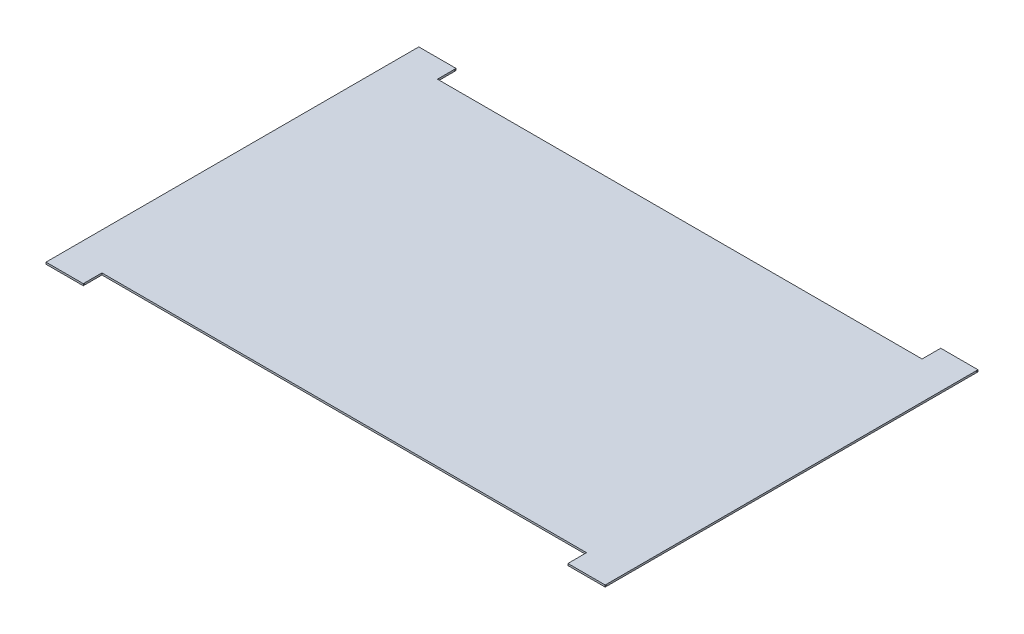
ISO-10303-21;
HEADER;
FILE_DESCRIPTION(('STEP AP214'),'2;1');
FILE_NAME('part.step','',(''),(''),'','','');
FILE_SCHEMA(('AUTOMOTIVE_DESIGN { 1 0 10303 214 1 1 1 1 }'));
ENDSEC;
DATA;
#1=APPLICATION_CONTEXT('core data for automotive mechanical design processes');
#2=APPLICATION_PROTOCOL_DEFINITION('international standard','automotive_design',2000,#1);
#3=PRODUCT_CONTEXT('',#1,'mechanical');
#4=PRODUCT('Part','Part','',(#3));
#5=PRODUCT_RELATED_PRODUCT_CATEGORY('part','',(#4));
#6=PRODUCT_DEFINITION_FORMATION('','',#4);
#7=PRODUCT_DEFINITION_CONTEXT('part definition',#1,'design');
#8=PRODUCT_DEFINITION('design','',#6,#7);
#9=PRODUCT_DEFINITION_SHAPE('','',#8);
#10=(LENGTH_UNIT() NAMED_UNIT(*) SI_UNIT(.MILLI.,.METRE.));
#11=(NAMED_UNIT(*) PLANE_ANGLE_UNIT() SI_UNIT($,.RADIAN.));
#12=(NAMED_UNIT(*) SI_UNIT($,.STERADIAN.) SOLID_ANGLE_UNIT());
#13=UNCERTAINTY_MEASURE_WITH_UNIT(LENGTH_MEASURE(1.E-05),#10,'distance_accuracy_value','');
#14=(GEOMETRIC_REPRESENTATION_CONTEXT(3) GLOBAL_UNCERTAINTY_ASSIGNED_CONTEXT((#13)) GLOBAL_UNIT_ASSIGNED_CONTEXT((#10,
#11,#12)) REPRESENTATION_CONTEXT('',''));
#15=CARTESIAN_POINT('',(0.,0.,0.));
#16=DIRECTION('',(0.,0.,1.));
#17=DIRECTION('',(1.,0.,0.));
#18=AXIS2_PLACEMENT_3D('',#15,#16,#17);
#19=CARTESIAN_POINT('',(2.,0.1,0.));
#20=DIRECTION('',(-1.,0.,0.));
#21=DIRECTION('',(0.,0.,1.));
#22=AXIS2_PLACEMENT_3D('',#19,#20,#21);
#23=PLANE('',#22);
#24=CARTESIAN_POINT('',(2.,0.05,-0.0500000000000014));
#25=DIRECTION('',(-1.,0.,0.));
#26=DIRECTION('',(0.,0.,1.));
#27=AXIS2_PLACEMENT_3D('',#24,#25,#26);
#28=CIRCLE('',#27,0.025000000000002);
#29=CARTESIAN_POINT('',(2.,0.05,-0.0249999999999994));
#30=VERTEX_POINT('',#29);
#31=EDGE_CURVE('E251',#30,#30,#28,.T.);
#32=ORIENTED_EDGE('',*,*,#31,.T.);
#33=EDGE_LOOP('',(#32));
#34=FACE_BOUND('',#33,.T.);
#35=DIRECTION('',(0.,0.,-1.));
#36=VECTOR('',#35,1.);
#37=CARTESIAN_POINT('',(2.,0.,0.));
#38=LINE('',#37,#36);
#39=CARTESIAN_POINT('',(2.,0.,0.));
#40=VERTEX_POINT('',#39);
#41=CARTESIAN_POINT('',(2.,0.,-1.));
#42=VERTEX_POINT('',#41);
#43=EDGE_CURVE('E156',#40,#42,#38,.T.);
#44=ORIENTED_EDGE('',*,*,#43,.T.);
#45=DIRECTION('',(0.,-1.,0.));
#46=VECTOR('',#45,1.);
#47=CARTESIAN_POINT('',(2.,0.1,-1.));
#48=LINE('',#47,#46);
#49=CARTESIAN_POINT('',(2.,0.1,-1.));
#50=VERTEX_POINT('',#49);
#51=EDGE_CURVE('E11',#50,#42,#48,.T.);
#52=ORIENTED_EDGE('',*,*,#51,.F.);
#53=DIRECTION('',(0.,0.,-1.));
#54=VECTOR('',#53,1.);
#55=CARTESIAN_POINT('',(2.,0.1,0.));
#56=LINE('',#55,#54);
#57=CARTESIAN_POINT('',(2.,0.1,0.));
#58=VERTEX_POINT('',#57);
#59=EDGE_CURVE('E235',#58,#50,#56,.T.);
#60=ORIENTED_EDGE('',*,*,#59,.F.);
#61=DIRECTION('',(0.,-1.,0.));
#62=VECTOR('',#61,1.);
#63=CARTESIAN_POINT('',(2.,0.1,0.));
#64=LINE('',#63,#62);
#65=EDGE_CURVE('E150',#58,#40,#64,.T.);
#66=ORIENTED_EDGE('',*,*,#65,.T.);
#67=EDGE_LOOP('',(#44,#52,#60,#66));
#68=FACE_BOUND('',#67,.T.);
#69=ADVANCED_FACE('F34',(#34,#68),#23,.F.);
#70=CARTESIAN_POINT('',(0.,0.1,-1.));
#71=DIRECTION('',(0.,0.,-1.));
#72=DIRECTION('',(-1.,0.,0.));
#73=AXIS2_PLACEMENT_3D('',#70,#71,#72);
#74=PLANE('',#73);
#75=DIRECTION('',(1.,0.,0.));
#76=VECTOR('',#75,1.);
#77=CARTESIAN_POINT('',(0.,0.,-1.));
#78=LINE('',#77,#76);
#79=CARTESIAN_POINT('',(28.,0.,-1.));
#80=VERTEX_POINT('',#79);
#81=EDGE_CURVE('E159',#42,#80,#78,.T.);
#82=ORIENTED_EDGE('',*,*,#81,.T.);
#83=DIRECTION('',(0.,-1.,0.));
#84=VECTOR('',#83,1.);
#85=CARTESIAN_POINT('',(28.,0.1,-1.));
#86=LINE('',#85,#84);
#87=CARTESIAN_POINT('',(28.,0.1,-1.));
#88=VERTEX_POINT('',#87);
#89=EDGE_CURVE('E42',#88,#80,#86,.T.);
#90=ORIENTED_EDGE('',*,*,#89,.F.);
#91=DIRECTION('',(1.,0.,0.));
#92=VECTOR('',#91,1.);
#93=CARTESIAN_POINT('',(0.,0.1,-1.));
#94=LINE('',#93,#92);
#95=EDGE_CURVE('E101',#50,#88,#94,.T.);
#96=ORIENTED_EDGE('',*,*,#95,.F.);
#97=ORIENTED_EDGE('',*,*,#51,.T.);
#98=EDGE_LOOP('',(#82,#90,#96,#97));
#99=FACE_BOUND('',#98,.T.);
#100=ADVANCED_FACE('F206',(#99),#74,.F.);
#101=CARTESIAN_POINT('',(28.,0.1,0.));
#102=DIRECTION('',(-1.,0.,0.));
#103=DIRECTION('',(0.,0.,1.));
#104=AXIS2_PLACEMENT_3D('',#101,#102,#103);
#105=PLANE('',#104);
#106=CARTESIAN_POINT('',(28.,0.05,-0.0500000000000014));
#107=DIRECTION('',(-1.,0.,0.));
#108=DIRECTION('',(0.,0.,1.));
#109=AXIS2_PLACEMENT_3D('',#106,#107,#108);
#110=CIRCLE('',#109,0.025000000000002);
#111=CARTESIAN_POINT('',(28.,0.05,-0.0249999999999994));
#112=VERTEX_POINT('',#111);
#113=EDGE_CURVE('E254',#112,#112,#110,.T.);
#114=ORIENTED_EDGE('',*,*,#113,.F.);
#115=EDGE_LOOP('',(#114));
#116=FACE_BOUND('',#115,.T.);
#117=DIRECTION('',(0.,0.,-1.));
#118=VECTOR('',#117,1.);
#119=CARTESIAN_POINT('',(28.,0.,0.));
#120=LINE('',#119,#118);
#121=CARTESIAN_POINT('',(28.,0.,0.));
#122=VERTEX_POINT('',#121);
#123=EDGE_CURVE('E163',#122,#80,#120,.T.);
#124=ORIENTED_EDGE('',*,*,#123,.F.);
#125=DIRECTION('',(0.,-1.,0.));
#126=VECTOR('',#125,1.);
#127=CARTESIAN_POINT('',(28.,0.1,0.));
#128=LINE('',#127,#126);
#129=CARTESIAN_POINT('',(28.,0.1,0.));
#130=VERTEX_POINT('',#129);
#131=EDGE_CURVE('E199',#130,#122,#128,.T.);
#132=ORIENTED_EDGE('',*,*,#131,.F.);
#133=DIRECTION('',(0.,0.,-1.));
#134=VECTOR('',#133,1.);
#135=CARTESIAN_POINT('',(28.,0.1,0.));
#136=LINE('',#135,#134);
#137=EDGE_CURVE('E205',#130,#88,#136,.T.);
#138=ORIENTED_EDGE('',*,*,#137,.T.);
#139=ORIENTED_EDGE('',*,*,#89,.T.);
#140=EDGE_LOOP('',(#124,#132,#138,#139));
#141=FACE_BOUND('',#140,.T.);
#142=ADVANCED_FACE('F203',(#116,#141),#105,.T.);
#143=CARTESIAN_POINT('',(0.,0.1,0.));
#144=DIRECTION('',(0.,0.,-1.));
#145=DIRECTION('',(-1.,0.,0.));
#146=AXIS2_PLACEMENT_3D('',#143,#144,#145);
#147=PLANE('',#146);
#148=DIRECTION('',(1.,0.,0.));
#149=VECTOR('',#148,1.);
#150=CARTESIAN_POINT('',(0.,0.,0.));
#151=LINE('',#150,#149);
#152=CARTESIAN_POINT('',(30.,0.,0.));
#153=VERTEX_POINT('',#152);
#154=EDGE_CURVE('E166',#122,#153,#151,.T.);
#155=ORIENTED_EDGE('',*,*,#154,.T.);
#156=DIRECTION('',(0.,-1.,0.));
#157=VECTOR('',#156,1.);
#158=CARTESIAN_POINT('',(30.,0.1,0.));
#159=LINE('',#158,#157);
#160=CARTESIAN_POINT('',(30.,0.1,0.));
#161=VERTEX_POINT('',#160);
#162=EDGE_CURVE('E196',#161,#153,#159,.T.);
#163=ORIENTED_EDGE('',*,*,#162,.F.);
#164=DIRECTION('',(1.,0.,0.));
#165=VECTOR('',#164,1.);
#166=CARTESIAN_POINT('',(0.,0.1,0.));
#167=LINE('',#166,#165);
#168=EDGE_CURVE('E152',#130,#161,#167,.T.);
#169=ORIENTED_EDGE('',*,*,#168,.F.);
#170=ORIENTED_EDGE('',*,*,#131,.T.);
#171=EDGE_LOOP('',(#155,#163,#169,#170));
#172=FACE_BOUND('',#171,.T.);
#173=ADVANCED_FACE('F215',(#172),#147,.F.);
#174=CARTESIAN_POINT('',(30.,0.1,0.));
#175=DIRECTION('',(-1.,0.,0.));
#176=DIRECTION('',(0.,0.,1.));
#177=AXIS2_PLACEMENT_3D('',#174,#175,#176);
#178=PLANE('',#177);
#179=CARTESIAN_POINT('',(30.,0.05,-0.0500000000000014));
#180=DIRECTION('',(1.,0.,0.));
#181=DIRECTION('',(0.,0.,1.));
#182=AXIS2_PLACEMENT_3D('',#179,#180,#181);
#183=CIRCLE('',#182,0.025000000000002);
#184=CARTESIAN_POINT('',(30.,0.05,-0.0249999999999994));
#185=VERTEX_POINT('',#184);
#186=EDGE_CURVE('E260',#185,#185,#183,.T.);
#187=ORIENTED_EDGE('',*,*,#186,.F.);
#188=EDGE_LOOP('',(#187));
#189=FACE_BOUND('',#188,.T.);
#190=CARTESIAN_POINT('',(30.,0.05,-19.95));
#191=DIRECTION('',(1.,0.,0.));
#192=DIRECTION('',(0.,0.,-1.));
#193=AXIS2_PLACEMENT_3D('',#190,#191,#192);
#194=CIRCLE('',#193,0.025000000000002);
#195=CARTESIAN_POINT('',(30.,0.05,-19.975));
#196=VERTEX_POINT('',#195);
#197=EDGE_CURVE('E248',#196,#196,#194,.T.);
#198=ORIENTED_EDGE('',*,*,#197,.F.);
#199=EDGE_LOOP('',(#198));
#200=FACE_BOUND('',#199,.T.);
#201=DIRECTION('',(0.,0.,-1.));
#202=VECTOR('',#201,1.);
#203=CARTESIAN_POINT('',(30.,0.,0.));
#204=LINE('',#203,#202);
#205=CARTESIAN_POINT('',(30.,0.,-20.));
#206=VERTEX_POINT('',#205);
#207=EDGE_CURVE('E168',#153,#206,#204,.T.);
#208=ORIENTED_EDGE('',*,*,#207,.T.);
#209=DIRECTION('',(0.,-1.,0.));
#210=VECTOR('',#209,1.);
#211=CARTESIAN_POINT('',(30.,0.1,-20.));
#212=LINE('',#211,#210);
#213=CARTESIAN_POINT('',(30.,0.1,-20.));
#214=VERTEX_POINT('',#213);
#215=EDGE_CURVE('E194',#214,#206,#212,.T.);
#216=ORIENTED_EDGE('',*,*,#215,.F.);
#217=DIRECTION('',(0.,0.,-1.));
#218=VECTOR('',#217,1.);
#219=CARTESIAN_POINT('',(30.,0.1,0.));
#220=LINE('',#219,#218);
#221=EDGE_CURVE('E221',#161,#214,#220,.T.);
#222=ORIENTED_EDGE('',*,*,#221,.F.);
#223=ORIENTED_EDGE('',*,*,#162,.T.);
#224=EDGE_LOOP('',(#208,#216,#222,#223));
#225=FACE_BOUND('',#224,.T.);
#226=ADVANCED_FACE('F219',(#189,#200,#225),#178,.F.);
#227=CARTESIAN_POINT('',(0.,0.1,-20.));
#228=DIRECTION('',(0.,0.,-1.));
#229=DIRECTION('',(-1.,0.,0.));
#230=AXIS2_PLACEMENT_3D('',#227,#228,#229);
#231=PLANE('',#230);
#232=DIRECTION('',(1.,0.,0.));
#233=VECTOR('',#232,1.);
#234=CARTESIAN_POINT('',(0.,0.,-20.));
#235=LINE('',#234,#233);
#236=CARTESIAN_POINT('',(28.,0.,-20.));
#237=VERTEX_POINT('',#236);
#238=EDGE_CURVE('E171',#237,#206,#235,.T.);
#239=ORIENTED_EDGE('',*,*,#238,.F.);
#240=DIRECTION('',(0.,-1.,0.));
#241=VECTOR('',#240,1.);
#242=CARTESIAN_POINT('',(28.,0.1,-20.));
#243=LINE('',#242,#241);
#244=CARTESIAN_POINT('',(28.,0.1,-20.));
#245=VERTEX_POINT('',#244);
#246=EDGE_CURVE('E192',#245,#237,#243,.T.);
#247=ORIENTED_EDGE('',*,*,#246,.F.);
#248=DIRECTION('',(1.,0.,0.));
#249=VECTOR('',#248,1.);
#250=CARTESIAN_POINT('',(0.,0.1,-20.));
#251=LINE('',#250,#249);
#252=EDGE_CURVE('E147',#245,#214,#251,.T.);
#253=ORIENTED_EDGE('',*,*,#252,.T.);
#254=ORIENTED_EDGE('',*,*,#215,.T.);
#255=EDGE_LOOP('',(#239,#247,#253,#254));
#256=FACE_BOUND('',#255,.T.);
#257=ADVANCED_FACE('F268',(#256),#231,.T.);
#258=CARTESIAN_POINT('',(28.,0.1,0.));
#259=DIRECTION('',(1.,0.,0.));
#260=DIRECTION('',(0.,0.,-1.));
#261=AXIS2_PLACEMENT_3D('',#258,#259,#260);
#262=PLANE('',#261);
#263=CARTESIAN_POINT('',(28.,0.05,-19.95));
#264=DIRECTION('',(1.,0.,0.));
#265=DIRECTION('',(0.,0.,-1.));
#266=AXIS2_PLACEMENT_3D('',#263,#264,#265);
#267=CIRCLE('',#266,0.025000000000002);
#268=CARTESIAN_POINT('',(28.,0.05,-19.975));
#269=VERTEX_POINT('',#268);
#270=EDGE_CURVE('E160',#269,#269,#267,.T.);
#271=ORIENTED_EDGE('',*,*,#270,.T.);
#272=EDGE_LOOP('',(#271));
#273=FACE_BOUND('',#272,.T.);
#274=DIRECTION('',(0.,0.,1.));
#275=VECTOR('',#274,1.);
#276=CARTESIAN_POINT('',(28.,0.,0.));
#277=LINE('',#276,#275);
#278=CARTESIAN_POINT('',(28.,0.,-19.));
#279=VERTEX_POINT('',#278);
#280=EDGE_CURVE('E174',#237,#279,#277,.T.);
#281=ORIENTED_EDGE('',*,*,#280,.T.);
#282=DIRECTION('',(0.,-1.,0.));
#283=VECTOR('',#282,1.);
#284=CARTESIAN_POINT('',(28.,0.1,-19.));
#285=LINE('',#284,#283);
#286=CARTESIAN_POINT('',(28.,0.1,-19.));
#287=VERTEX_POINT('',#286);
#288=EDGE_CURVE('E190',#287,#279,#285,.T.);
#289=ORIENTED_EDGE('',*,*,#288,.F.);
#290=DIRECTION('',(0.,0.,1.));
#291=VECTOR('',#290,1.);
#292=CARTESIAN_POINT('',(28.,0.1,0.));
#293=LINE('',#292,#291);
#294=EDGE_CURVE('E225',#245,#287,#293,.T.);
#295=ORIENTED_EDGE('',*,*,#294,.F.);
#296=ORIENTED_EDGE('',*,*,#246,.T.);
#297=EDGE_LOOP('',(#281,#289,#295,#296));
#298=FACE_BOUND('',#297,.T.);
#299=ADVANCED_FACE('F280',(#273,#298),#262,.F.);
#300=CARTESIAN_POINT('',(0.,0.1,-19.));
#301=DIRECTION('',(0.,0.,-1.));
#302=DIRECTION('',(-1.,0.,0.));
#303=AXIS2_PLACEMENT_3D('',#300,#301,#302);
#304=PLANE('',#303);
#305=DIRECTION('',(1.,0.,0.));
#306=VECTOR('',#305,1.);
#307=CARTESIAN_POINT('',(0.,0.,-19.));
#308=LINE('',#307,#306);
#309=CARTESIAN_POINT('',(2.,0.,-19.));
#310=VERTEX_POINT('',#309);
#311=EDGE_CURVE('E177',#310,#279,#308,.T.);
#312=ORIENTED_EDGE('',*,*,#311,.F.);
#313=DIRECTION('',(0.,-1.,0.));
#314=VECTOR('',#313,1.);
#315=CARTESIAN_POINT('',(2.,0.1,-19.));
#316=LINE('',#315,#314);
#317=CARTESIAN_POINT('',(2.,0.1,-19.));
#318=VERTEX_POINT('',#317);
#319=EDGE_CURVE('E188',#318,#310,#316,.T.);
#320=ORIENTED_EDGE('',*,*,#319,.F.);
#321=DIRECTION('',(1.,0.,0.));
#322=VECTOR('',#321,1.);
#323=CARTESIAN_POINT('',(0.,0.1,-19.));
#324=LINE('',#323,#322);
#325=EDGE_CURVE('E228',#318,#287,#324,.T.);
#326=ORIENTED_EDGE('',*,*,#325,.T.);
#327=ORIENTED_EDGE('',*,*,#288,.T.);
#328=EDGE_LOOP('',(#312,#320,#326,#327));
#329=FACE_BOUND('',#328,.T.);
#330=ADVANCED_FACE('F283',(#329),#304,.T.);
#331=CARTESIAN_POINT('',(2.,0.1,0.));
#332=DIRECTION('',(1.,0.,0.));
#333=DIRECTION('',(0.,0.,-1.));
#334=AXIS2_PLACEMENT_3D('',#331,#332,#333);
#335=PLANE('',#334);
#336=CARTESIAN_POINT('',(2.,0.05,-19.95));
#337=DIRECTION('',(1.,0.,0.));
#338=DIRECTION('',(0.,0.,-1.));
#339=AXIS2_PLACEMENT_3D('',#336,#337,#338);
#340=CIRCLE('',#339,0.025000000000002);
#341=CARTESIAN_POINT('',(2.,0.05,-19.975));
#342=VERTEX_POINT('',#341);
#343=EDGE_CURVE('E242',#342,#342,#340,.T.);
#344=ORIENTED_EDGE('',*,*,#343,.F.);
#345=EDGE_LOOP('',(#344));
#346=FACE_BOUND('',#345,.T.);
#347=DIRECTION('',(0.,0.,1.));
#348=VECTOR('',#347,1.);
#349=CARTESIAN_POINT('',(2.,0.,0.));
#350=LINE('',#349,#348);
#351=CARTESIAN_POINT('',(2.,0.,-20.));
#352=VERTEX_POINT('',#351);
#353=EDGE_CURVE('E180',#352,#310,#350,.T.);
#354=ORIENTED_EDGE('',*,*,#353,.F.);
#355=DIRECTION('',(0.,-1.,0.));
#356=VECTOR('',#355,1.);
#357=CARTESIAN_POINT('',(2.,0.1,-20.));
#358=LINE('',#357,#356);
#359=CARTESIAN_POINT('',(2.,0.1,-20.));
#360=VERTEX_POINT('',#359);
#361=EDGE_CURVE('E138',#360,#352,#358,.T.);
#362=ORIENTED_EDGE('',*,*,#361,.F.);
#363=DIRECTION('',(0.,0.,1.));
#364=VECTOR('',#363,1.);
#365=CARTESIAN_POINT('',(2.,0.1,0.));
#366=LINE('',#365,#364);
#367=EDGE_CURVE('E145',#360,#318,#366,.T.);
#368=ORIENTED_EDGE('',*,*,#367,.T.);
#369=ORIENTED_EDGE('',*,*,#319,.T.);
#370=EDGE_LOOP('',(#354,#362,#368,#369));
#371=FACE_BOUND('',#370,.T.);
#372=ADVANCED_FACE('F233',(#346,#371),#335,.T.);
#373=CARTESIAN_POINT('',(0.,0.,-20.));
#374=VERTEX_POINT('',#373);
#375=EDGE_CURVE('E133',#374,#352,#235,.T.);
#376=ORIENTED_EDGE('',*,*,#375,.F.);
#377=DIRECTION('',(0.,-1.,0.));
#378=VECTOR('',#377,1.);
#379=CARTESIAN_POINT('',(0.,0.1,-20.));
#380=LINE('',#379,#378);
#381=CARTESIAN_POINT('',(0.,0.1,-20.));
#382=VERTEX_POINT('',#381);
#383=EDGE_CURVE('E128',#382,#374,#380,.T.);
#384=ORIENTED_EDGE('',*,*,#383,.F.);
#385=EDGE_CURVE('E131',#382,#360,#251,.T.);
#386=ORIENTED_EDGE('',*,*,#385,.T.);
#387=ORIENTED_EDGE('',*,*,#361,.T.);
#388=EDGE_LOOP('',(#376,#384,#386,#387));
#389=FACE_BOUND('',#388,.T.);
#390=ADVANCED_FACE('F130',(#389),#231,.T.);
#391=CARTESIAN_POINT('',(0.,0.1,0.));
#392=DIRECTION('',(-1.,0.,0.));
#393=DIRECTION('',(0.,0.,1.));
#394=AXIS2_PLACEMENT_3D('',#391,#392,#393);
#395=PLANE('',#394);
#396=CARTESIAN_POINT('',(0.,0.05,-0.0500000000000014));
#397=DIRECTION('',(-1.,0.,0.));
#398=DIRECTION('',(0.,0.,1.));
#399=AXIS2_PLACEMENT_3D('',#396,#397,#398);
#400=CIRCLE('',#399,0.025000000000002);
#401=CARTESIAN_POINT('',(0.,0.05,-0.0249999999999994));
#402=VERTEX_POINT('',#401);
#403=EDGE_CURVE('E257',#402,#402,#400,.F.);
#404=ORIENTED_EDGE('',*,*,#403,.T.);
#405=EDGE_LOOP('',(#404));
#406=FACE_BOUND('',#405,.T.);
#407=CARTESIAN_POINT('',(0.,0.05,-19.95));
#408=DIRECTION('',(-1.,0.,0.));
#409=DIRECTION('',(0.,0.,1.));
#410=AXIS2_PLACEMENT_3D('',#407,#408,#409);
#411=CIRCLE('',#410,0.025000000000002);
#412=CARTESIAN_POINT('',(0.,0.05,-19.925));
#413=VERTEX_POINT('',#412);
#414=EDGE_CURVE('E245',#413,#413,#411,.F.);
#415=ORIENTED_EDGE('',*,*,#414,.T.);
#416=EDGE_LOOP('',(#415));
#417=FACE_BOUND('',#416,.T.);
#418=DIRECTION('',(0.,0.,-1.));
#419=VECTOR('',#418,1.);
#420=CARTESIAN_POINT('',(0.,0.,0.));
#421=LINE('',#420,#419);
#422=CARTESIAN_POINT('',(0.,0.,0.));
#423=VERTEX_POINT('',#422);
#424=EDGE_CURVE('E183',#423,#374,#421,.T.);
#425=ORIENTED_EDGE('',*,*,#424,.F.);
#426=DIRECTION('',(0.,-1.,0.));
#427=VECTOR('',#426,1.);
#428=CARTESIAN_POINT('',(0.,0.1,0.));
#429=LINE('',#428,#427);
#430=CARTESIAN_POINT('',(0.,0.1,0.));
#431=VERTEX_POINT('',#430);
#432=EDGE_CURVE('E90',#431,#423,#429,.T.);
#433=ORIENTED_EDGE('',*,*,#432,.F.);
#434=DIRECTION('',(0.,0.,-1.));
#435=VECTOR('',#434,1.);
#436=CARTESIAN_POINT('',(0.,0.1,0.));
#437=LINE('',#436,#435);
#438=EDGE_CURVE('E142',#431,#382,#437,.T.);
#439=ORIENTED_EDGE('',*,*,#438,.T.);
#440=ORIENTED_EDGE('',*,*,#383,.T.);
#441=EDGE_LOOP('',(#425,#433,#439,#440));
#442=FACE_BOUND('',#441,.T.);
#443=ADVANCED_FACE('F148',(#406,#417,#442),#395,.T.);
#444=EDGE_CURVE('E93',#423,#40,#151,.T.);
#445=ORIENTED_EDGE('',*,*,#444,.T.);
#446=ORIENTED_EDGE('',*,*,#65,.F.);
#447=EDGE_CURVE('E50',#431,#58,#167,.T.);
#448=ORIENTED_EDGE('',*,*,#447,.F.);
#449=ORIENTED_EDGE('',*,*,#432,.T.);
#450=EDGE_LOOP('',(#445,#446,#448,#449));
#451=FACE_BOUND('',#450,.T.);
#452=ADVANCED_FACE('F304',(#451),#147,.F.);
#453=CARTESIAN_POINT('',(0.,0.1,0.));
#454=DIRECTION('',(0.,1.,0.));
#455=DIRECTION('',(0.,0.,1.));
#456=AXIS2_PLACEMENT_3D('',#453,#454,#455);
#457=PLANE('',#456);
#458=ORIENTED_EDGE('',*,*,#59,.T.);
#459=ORIENTED_EDGE('',*,*,#95,.T.);
#460=ORIENTED_EDGE('',*,*,#137,.F.);
#461=ORIENTED_EDGE('',*,*,#168,.T.);
#462=ORIENTED_EDGE('',*,*,#221,.T.);
#463=ORIENTED_EDGE('',*,*,#252,.F.);
#464=ORIENTED_EDGE('',*,*,#294,.T.);
#465=ORIENTED_EDGE('',*,*,#325,.F.);
#466=ORIENTED_EDGE('',*,*,#367,.F.);
#467=ORIENTED_EDGE('',*,*,#385,.F.);
#468=ORIENTED_EDGE('',*,*,#438,.F.);
#469=ORIENTED_EDGE('',*,*,#447,.T.);
#470=EDGE_LOOP('',(#458,#459,#460,#461,#462,#463,#464,#465,#466,#467,#468,#469));
#471=FACE_BOUND('',#470,.T.);
#472=ADVANCED_FACE('F141',(#471),#457,.T.);
#473=CARTESIAN_POINT('',(0.,0.,0.));
#474=DIRECTION('',(0.,1.,0.));
#475=DIRECTION('',(0.,0.,1.));
#476=AXIS2_PLACEMENT_3D('',#473,#474,#475);
#477=PLANE('',#476);
#478=ORIENTED_EDGE('',*,*,#43,.F.);
#479=ORIENTED_EDGE('',*,*,#444,.F.);
#480=ORIENTED_EDGE('',*,*,#424,.T.);
#481=ORIENTED_EDGE('',*,*,#375,.T.);
#482=ORIENTED_EDGE('',*,*,#353,.T.);
#483=ORIENTED_EDGE('',*,*,#311,.T.);
#484=ORIENTED_EDGE('',*,*,#280,.F.);
#485=ORIENTED_EDGE('',*,*,#238,.T.);
#486=ORIENTED_EDGE('',*,*,#207,.F.);
#487=ORIENTED_EDGE('',*,*,#154,.F.);
#488=ORIENTED_EDGE('',*,*,#123,.T.);
#489=ORIENTED_EDGE('',*,*,#81,.F.);
#490=EDGE_LOOP('',(#478,#479,#480,#481,#482,#483,#484,#485,#486,#487,#488,#489));
#491=FACE_BOUND('',#490,.T.);
#492=ADVANCED_FACE('F211',(#491),#477,.F.);
#493=CARTESIAN_POINT('',(-0.0707106781186601,0.05,-19.95));
#494=DIRECTION('',(1.,0.,0.));
#495=DIRECTION('',(0.,0.,-1.));
#496=AXIS2_PLACEMENT_3D('',#493,#494,#495);
#497=CYLINDRICAL_SURFACE('',#496,0.025000000000002);
#498=ORIENTED_EDGE('',*,*,#343,.T.);
#499=EDGE_LOOP('',(#498));
#500=FACE_BOUND('',#499,.T.);
#501=ORIENTED_EDGE('',*,*,#414,.F.);
#502=EDGE_LOOP('',(#501));
#503=FACE_BOUND('',#502,.T.);
#504=ADVANCED_FACE('F276',(#500,#503),#497,.F.);
#505=ORIENTED_EDGE('',*,*,#197,.T.);
#506=EDGE_LOOP('',(#505));
#507=FACE_BOUND('',#506,.T.);
#508=ORIENTED_EDGE('',*,*,#270,.F.);
#509=EDGE_LOOP('',(#508));
#510=FACE_BOUND('',#509,.T.);
#511=ADVANCED_FACE('F272',(#507,#510),#497,.F.);
#512=CARTESIAN_POINT('',(-0.0707106781186601,0.05,-0.0500000000000014));
#513=DIRECTION('',(1.,0.,0.));
#514=DIRECTION('',(0.,0.,-1.));
#515=AXIS2_PLACEMENT_3D('',#512,#513,#514);
#516=CYLINDRICAL_SURFACE('',#515,0.025000000000002);
#517=ORIENTED_EDGE('',*,*,#403,.F.);
#518=EDGE_LOOP('',(#517));
#519=FACE_BOUND('',#518,.T.);
#520=ORIENTED_EDGE('',*,*,#31,.F.);
#521=EDGE_LOOP('',(#520));
#522=FACE_BOUND('',#521,.T.);
#523=ADVANCED_FACE('F275',(#519,#522),#516,.F.);
#524=ORIENTED_EDGE('',*,*,#113,.T.);
#525=EDGE_LOOP('',(#524));
#526=FACE_BOUND('',#525,.T.);
#527=ORIENTED_EDGE('',*,*,#186,.T.);
#528=EDGE_LOOP('',(#527));
#529=FACE_BOUND('',#528,.T.);
#530=ADVANCED_FACE('F264',(#526,#529),#516,.F.);
#531=CLOSED_SHELL('',(#69,#100,#142,#173,#226,#257,#299,#330,#372,#390,#443,#452,#472,#492,#504,
#511,#523,#530));
#532=MANIFOLD_SOLID_BREP('B2',#531);
#533=ADVANCED_BREP_SHAPE_REPRESENTATION('',(#18,#532),#14);
#534=SHAPE_DEFINITION_REPRESENTATION(#9,#533);
ENDSEC;
END-ISO-10303-21;
